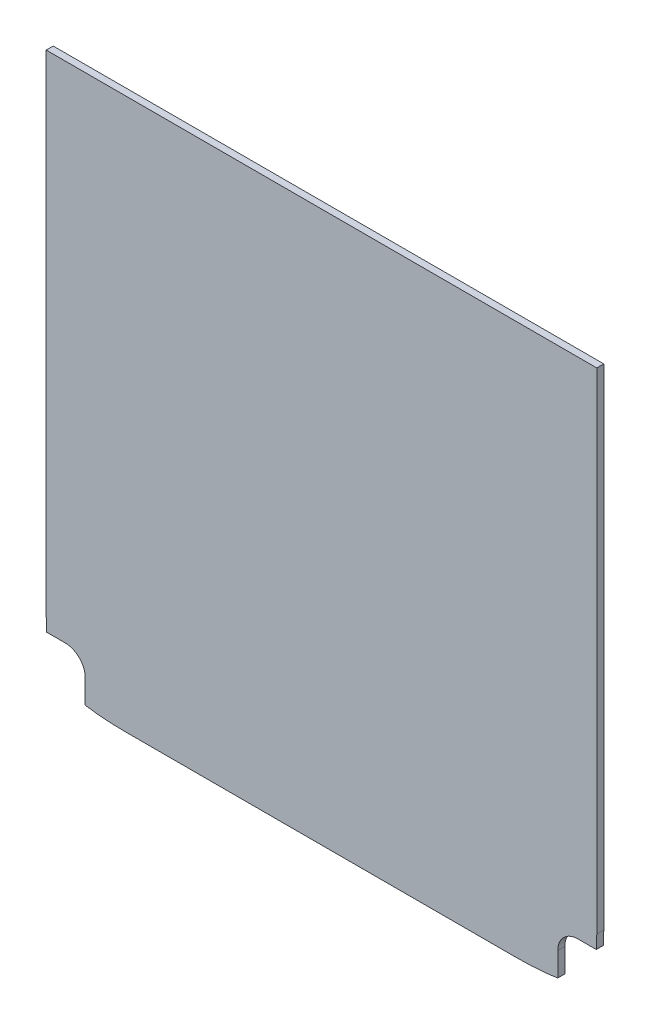
ISO-10303-21;
HEADER;
FILE_DESCRIPTION(('STEP AP214'),'2;1');
FILE_NAME('part.step','',(''),(''),'','','');
FILE_SCHEMA(('AUTOMOTIVE_DESIGN { 1 0 10303 214 1 1 1 1 }'));
ENDSEC;
DATA;
#1=APPLICATION_CONTEXT('core data for automotive mechanical design processes');
#2=APPLICATION_PROTOCOL_DEFINITION('international standard','automotive_design',2000,#1);
#3=PRODUCT_CONTEXT('',#1,'mechanical');
#4=PRODUCT('Part','Part','',(#3));
#5=PRODUCT_RELATED_PRODUCT_CATEGORY('part','',(#4));
#6=PRODUCT_DEFINITION_FORMATION('','',#4);
#7=PRODUCT_DEFINITION_CONTEXT('part definition',#1,'design');
#8=PRODUCT_DEFINITION('design','',#6,#7);
#9=PRODUCT_DEFINITION_SHAPE('','',#8);
#10=(LENGTH_UNIT() NAMED_UNIT(*) SI_UNIT(.MILLI.,.METRE.));
#11=(NAMED_UNIT(*) PLANE_ANGLE_UNIT() SI_UNIT($,.RADIAN.));
#12=(NAMED_UNIT(*) SI_UNIT($,.STERADIAN.) SOLID_ANGLE_UNIT());
#13=UNCERTAINTY_MEASURE_WITH_UNIT(LENGTH_MEASURE(1.E-05),#10,'distance_accuracy_value','');
#14=(GEOMETRIC_REPRESENTATION_CONTEXT(3) GLOBAL_UNCERTAINTY_ASSIGNED_CONTEXT((#13)) GLOBAL_UNIT_ASSIGNED_CONTEXT((#10,
#11,#12)) REPRESENTATION_CONTEXT('',''));
#15=CARTESIAN_POINT('',(0.,0.,0.));
#16=DIRECTION('',(0.,0.,1.));
#17=DIRECTION('',(1.,0.,0.));
#18=AXIS2_PLACEMENT_3D('',#15,#16,#17);
#19=CARTESIAN_POINT('',(-31.4,-3.06999999999998,-1.8));
#20=DIRECTION('',(0.,-1.,0.));
#21=DIRECTION('',(0.,0.,-1.));
#22=AXIS2_PLACEMENT_3D('',#19,#20,#21);
#23=PLANE('',#22);
#24=DIRECTION('',(-1.,0.,0.));
#25=VECTOR('',#24,1.);
#26=CARTESIAN_POINT('',(-31.4,-3.06999999999998,-2.6));
#27=LINE('',#26,#25);
#28=CARTESIAN_POINT('',(31.4,-3.06999999999998,-2.6));
#29=VERTEX_POINT('',#28);
#30=CARTESIAN_POINT('',(-31.4,-3.06999999999998,-2.6));
#31=VERTEX_POINT('',#30);
#32=EDGE_CURVE('E194',#29,#31,#27,.T.);
#33=ORIENTED_EDGE('',*,*,#32,.T.);
#34=DIRECTION('',(0.,0.,-1.));
#35=VECTOR('',#34,1.);
#36=CARTESIAN_POINT('',(-31.4,-3.06999999999998,-1.8));
#37=LINE('',#36,#35);
#38=CARTESIAN_POINT('',(-31.4,-3.06999999999998,-1.8));
#39=VERTEX_POINT('',#38);
#40=EDGE_CURVE('E11',#39,#31,#37,.T.);
#41=ORIENTED_EDGE('',*,*,#40,.F.);
#42=DIRECTION('',(-1.,0.,0.));
#43=VECTOR('',#42,1.);
#44=CARTESIAN_POINT('',(-31.4,-3.06999999999998,-1.8));
#45=LINE('',#44,#43);
#46=CARTESIAN_POINT('',(31.4,-3.06999999999998,-1.8));
#47=VERTEX_POINT('',#46);
#48=EDGE_CURVE('E274',#47,#39,#45,.T.);
#49=ORIENTED_EDGE('',*,*,#48,.F.);
#50=DIRECTION('',(0.,0.,-1.));
#51=VECTOR('',#50,1.);
#52=CARTESIAN_POINT('',(31.4,-3.06999999999998,-1.8));
#53=LINE('',#52,#51);
#54=EDGE_CURVE('E208',#47,#29,#53,.T.);
#55=ORIENTED_EDGE('',*,*,#54,.T.);
#56=EDGE_LOOP('',(#33,#41,#49,#55));
#57=FACE_BOUND('',#56,.T.);
#58=ADVANCED_FACE('F33',(#57),#23,.F.);
#59=CARTESIAN_POINT('',(-31.4,-59.,-1.8));
#60=DIRECTION('',(1.,0.,0.));
#61=DIRECTION('',(0.,1.,0.));
#62=AXIS2_PLACEMENT_3D('',#59,#60,#61);
#63=PLANE('',#62);
#64=DIRECTION('',(0.,-1.,0.));
#65=VECTOR('',#64,1.);
#66=CARTESIAN_POINT('',(-31.4,-59.,-2.6));
#67=LINE('',#66,#65);
#68=CARTESIAN_POINT('',(-31.4,-59.,-2.6));
#69=VERTEX_POINT('',#68);
#70=EDGE_CURVE('E200',#31,#69,#67,.T.);
#71=ORIENTED_EDGE('',*,*,#70,.T.);
#72=DIRECTION('',(0.,0.,-1.));
#73=VECTOR('',#72,1.);
#74=CARTESIAN_POINT('',(-31.4,-59.,-1.8));
#75=LINE('',#74,#73);
#76=CARTESIAN_POINT('',(-31.4,-59.,-1.8));
#77=VERTEX_POINT('',#76);
#78=EDGE_CURVE('E42',#77,#69,#75,.T.);
#79=ORIENTED_EDGE('',*,*,#78,.F.);
#80=DIRECTION('',(0.,-1.,0.));
#81=VECTOR('',#80,1.);
#82=CARTESIAN_POINT('',(-31.4,-59.,-1.8));
#83=LINE('',#82,#81);
#84=EDGE_CURVE('E113',#39,#77,#83,.T.);
#85=ORIENTED_EDGE('',*,*,#84,.F.);
#86=ORIENTED_EDGE('',*,*,#40,.T.);
#87=EDGE_LOOP('',(#71,#79,#85,#86));
#88=FACE_BOUND('',#87,.T.);
#89=ADVANCED_FACE('F265',(#88),#63,.F.);
#90=CARTESIAN_POINT('',(-31.4,-59.,-1.8));
#91=CARTESIAN_POINT('',(-31.4,-59.5647726423221,-1.8));
#92=CARTESIAN_POINT('',(-31.3799273594437,-60.0817827199579,-1.8));
#93=CARTESIAN_POINT('',(-31.3422494533232,-60.5499999999461,-1.8));
#94=B_SPLINE_CURVE_WITH_KNOTS('',3,(#90,#91,#92,#93),.UNSPECIFIED.,.F.,.F.,(4,4),(0.,
0.0796346763149644),.UNSPECIFIED.);
#95=DIRECTION('',(0.,0.,-1.));
#96=VECTOR('',#95,1.);
#97=SURFACE_OF_LINEAR_EXTRUSION('',#94,#96);
#98=CARTESIAN_POINT('',(-31.4,-59.,-2.6));
#99=CARTESIAN_POINT('',(-31.4,-59.5647726423221,-2.6));
#100=CARTESIAN_POINT('',(-31.3799273594437,-60.0817827199579,-2.6));
#101=CARTESIAN_POINT('',(-31.3422494533232,-60.5499999999461,-2.6));
#102=B_SPLINE_CURVE_WITH_KNOTS('',3,(#98,#99,#100,#101),.UNSPECIFIED.,.F.,.F.,(4,4),(0.,
0.0796346763149644),.UNSPECIFIED.);
#103=CARTESIAN_POINT('',(-31.3422494533232,-60.5499999999461,-2.6));
#104=VERTEX_POINT('',#103);
#105=EDGE_CURVE('E248',#69,#104,#102,.T.);
#106=ORIENTED_EDGE('',*,*,#105,.T.);
#107=DIRECTION('',(0.,0.,-1.));
#108=VECTOR('',#107,1.);
#109=CARTESIAN_POINT('',(-31.3422494533232,-60.5499999999461,-1.8));
#110=LINE('',#109,#108);
#111=CARTESIAN_POINT('',(-31.3422494533232,-60.5499999999461,-1.8));
#112=VERTEX_POINT('',#111);
#113=EDGE_CURVE('E221',#112,#104,#110,.T.);
#114=ORIENTED_EDGE('',*,*,#113,.F.);
#115=CARTESIAN_POINT('',(-31.3422494533232,-60.5499999999461,-1.8));
#116=CARTESIAN_POINT('',(-31.3799273594437,-60.0817827199579,-1.8));
#117=CARTESIAN_POINT('',(-31.4,-59.5647726423221,-1.8));
#118=CARTESIAN_POINT('',(-31.4,-59.,-1.8));
#119=B_SPLINE_CURVE_WITH_KNOTS('',3,(#115,#116,#117,#118),.UNSPECIFIED.,.F.,.F.,(4,4),(0.,
0.0796346763149644),.UNSPECIFIED.);
#120=EDGE_CURVE('E242',#77,#112,#119,.F.);
#121=ORIENTED_EDGE('',*,*,#120,.F.);
#122=ORIENTED_EDGE('',*,*,#78,.T.);
#123=EDGE_LOOP('',(#106,#114,#121,#122));
#124=FACE_BOUND('',#123,.T.);
#125=ADVANCED_FACE('F254',(#124),#97,.F.);
#126=CARTESIAN_POINT('',(-29.2500000000046,-60.5499999999461,-1.8));
#127=DIRECTION('',(0.,1.,0.));
#128=DIRECTION('',(0.,0.,1.));
#129=AXIS2_PLACEMENT_3D('',#126,#127,#128);
#130=PLANE('',#129);
#131=DIRECTION('',(1.,0.,0.));
#132=VECTOR('',#131,1.);
#133=CARTESIAN_POINT('',(-29.2500000000046,-60.5499999999461,-2.6));
#134=LINE('',#133,#132);
#135=CARTESIAN_POINT('',(-29.2500000000046,-60.5499999999461,-2.6));
#136=VERTEX_POINT('',#135);
#137=EDGE_CURVE('E204',#104,#136,#134,.T.);
#138=ORIENTED_EDGE('',*,*,#137,.T.);
#139=DIRECTION('',(0.,0.,-1.));
#140=VECTOR('',#139,1.);
#141=CARTESIAN_POINT('',(-29.2500000000046,-60.5499999999461,-1.8));
#142=LINE('',#141,#140);
#143=CARTESIAN_POINT('',(-29.2500000000046,-60.5499999999461,-1.8));
#144=VERTEX_POINT('',#143);
#145=EDGE_CURVE('E218',#144,#136,#142,.T.);
#146=ORIENTED_EDGE('',*,*,#145,.F.);
#147=DIRECTION('',(1.,0.,0.));
#148=VECTOR('',#147,1.);
#149=CARTESIAN_POINT('',(-29.2500000000046,-60.5499999999461,-1.8));
#150=LINE('',#149,#148);
#151=EDGE_CURVE('E239',#112,#144,#150,.T.);
#152=ORIENTED_EDGE('',*,*,#151,.F.);
#153=ORIENTED_EDGE('',*,*,#113,.T.);
#154=EDGE_LOOP('',(#138,#146,#152,#153));
#155=FACE_BOUND('',#154,.T.);
#156=ADVANCED_FACE('F264',(#155),#130,.F.);
#157=CARTESIAN_POINT('',(-29.2499999999962,-62.8499999999461,-1.8));
#158=DIRECTION('',(0.,0.,-1.));
#159=DIRECTION('',(-1.,0.,0.));
#160=AXIS2_PLACEMENT_3D('',#157,#158,#159);
#161=CYLINDRICAL_SURFACE('',#160,2.30000000000001);
#162=CARTESIAN_POINT('',(-29.2499999999962,-62.8499999999461,-2.6));
#163=DIRECTION('',(0.,0.,-1.));
#164=DIRECTION('',(1.,0.,0.));
#165=AXIS2_PLACEMENT_3D('',#162,#163,#164);
#166=CIRCLE('',#165,2.30000000000001);
#167=CARTESIAN_POINT('',(-26.9499999999962,-62.8500000000007,-2.6));
#168=VERTEX_POINT('',#167);
#169=EDGE_CURVE('E201',#136,#168,#166,.T.);
#170=ORIENTED_EDGE('',*,*,#169,.T.);
#171=DIRECTION('',(0.,0.,-1.));
#172=VECTOR('',#171,1.);
#173=CARTESIAN_POINT('',(-26.9499999999962,-62.8500000000007,-1.8));
#174=LINE('',#173,#172);
#175=CARTESIAN_POINT('',(-26.9499999999962,-62.8500000000007,-1.8));
#176=VERTEX_POINT('',#175);
#177=EDGE_CURVE('E215',#176,#168,#174,.T.);
#178=ORIENTED_EDGE('',*,*,#177,.F.);
#179=CARTESIAN_POINT('',(-29.2499999999962,-62.8499999999461,-1.8));
#180=DIRECTION('',(0.,0.,-1.));
#181=DIRECTION('',(1.,0.,0.));
#182=AXIS2_PLACEMENT_3D('',#179,#180,#181);
#183=CIRCLE('',#182,2.30000000000001);
#184=EDGE_CURVE('E241',#144,#176,#183,.T.);
#185=ORIENTED_EDGE('',*,*,#184,.F.);
#186=ORIENTED_EDGE('',*,*,#145,.T.);
#187=EDGE_LOOP('',(#170,#178,#185,#186));
#188=FACE_BOUND('',#187,.T.);
#189=ADVANCED_FACE('F472',(#188),#161,.F.);
#190=CARTESIAN_POINT('',(-26.9499999999962,-65.5586526538853,-1.8));
#191=DIRECTION('',(1.,0.,0.));
#192=DIRECTION('',(0.,0.,-1.));
#193=AXIS2_PLACEMENT_3D('',#190,#191,#192);
#194=PLANE('',#193);
#195=DIRECTION('',(0.,-1.,0.));
#196=VECTOR('',#195,1.);
#197=CARTESIAN_POINT('',(-26.9499999999962,-65.5586526538853,-2.6));
#198=LINE('',#197,#196);
#199=CARTESIAN_POINT('',(-26.9499999999962,-65.5586526538853,-2.6));
#200=VERTEX_POINT('',#199);
#201=EDGE_CURVE('E203',#168,#200,#198,.T.);
#202=ORIENTED_EDGE('',*,*,#201,.T.);
#203=DIRECTION('',(0.,0.,-1.));
#204=VECTOR('',#203,1.);
#205=CARTESIAN_POINT('',(-26.9499999999962,-65.5586526538853,-1.8));
#206=LINE('',#205,#204);
#207=CARTESIAN_POINT('',(-26.9499999999962,-65.5586526538853,-1.8));
#208=VERTEX_POINT('',#207);
#209=EDGE_CURVE('E219',#208,#200,#206,.T.);
#210=ORIENTED_EDGE('',*,*,#209,.F.);
#211=DIRECTION('',(0.,-1.,0.));
#212=VECTOR('',#211,1.);
#213=CARTESIAN_POINT('',(-26.9499999999962,-65.5586526538853,-1.8));
#214=LINE('',#213,#212);
#215=EDGE_CURVE('E279',#176,#208,#214,.T.);
#216=ORIENTED_EDGE('',*,*,#215,.F.);
#217=ORIENTED_EDGE('',*,*,#177,.T.);
#218=EDGE_LOOP('',(#202,#210,#216,#217));
#219=FACE_BOUND('',#218,.T.);
#220=ADVANCED_FACE('F296',(#219),#194,.F.);
#221=CARTESIAN_POINT('',(-26.9499999999962,-65.5586526538853,-1.8));
#222=CARTESIAN_POINT('',(-26.3530525880404,-65.6660159480834,-1.8));
#223=CARTESIAN_POINT('',(-25.665739747565,-65.7491722547393,-1.8));
#224=CARTESIAN_POINT('',(-24.0328892150861,-65.8692163600802,-1.8));
#225=CARTESIAN_POINT('',(-23.0666253583551,-65.9,-1.8));
#226=CARTESIAN_POINT('',(-22.,-65.9,-1.8));
#227=B_SPLINE_CURVE_WITH_KNOTS('',3,(#221,#222,#223,#224,#225,#226),.UNSPECIFIED.,.F.,.F.,(4,2,
4),(0.762959975228664,0.875000000000001,1.),.UNSPECIFIED.);
#228=DIRECTION('',(0.,0.,-1.));
#229=VECTOR('',#228,1.);
#230=SURFACE_OF_LINEAR_EXTRUSION('',#227,#229);
#231=CARTESIAN_POINT('',(-26.9499999999962,-65.5586526538853,-2.6));
#232=CARTESIAN_POINT('',(-26.3530525880404,-65.6660159480834,-2.6));
#233=CARTESIAN_POINT('',(-25.665739747565,-65.7491722547393,-2.6));
#234=CARTESIAN_POINT('',(-24.0328892150861,-65.8692163600802,-2.6));
#235=CARTESIAN_POINT('',(-23.0666253583551,-65.9,-2.6));
#236=CARTESIAN_POINT('',(-22.,-65.9,-2.6));
#237=B_SPLINE_CURVE_WITH_KNOTS('',3,(#231,#232,#233,#234,#235,#236),.UNSPECIFIED.,.F.,.F.,(4,2,
4),(0.762959975228664,0.875000000000001,1.),.UNSPECIFIED.);
#238=CARTESIAN_POINT('',(-22.,-65.9,-2.6));
#239=VERTEX_POINT('',#238);
#240=EDGE_CURVE('E321',#200,#239,#237,.T.);
#241=ORIENTED_EDGE('',*,*,#240,.T.);
#242=DIRECTION('',(0.,0.,-1.));
#243=VECTOR('',#242,1.);
#244=CARTESIAN_POINT('',(-22.,-65.9,-1.8));
#245=LINE('',#244,#243);
#246=CARTESIAN_POINT('',(-22.,-65.9,-1.8));
#247=VERTEX_POINT('',#246);
#248=EDGE_CURVE('E377',#247,#239,#245,.T.);
#249=ORIENTED_EDGE('',*,*,#248,.F.);
#250=CARTESIAN_POINT('',(-22.,-65.9,-1.8));
#251=CARTESIAN_POINT('',(-23.0666253583551,-65.9,-1.8));
#252=CARTESIAN_POINT('',(-24.0328892150861,-65.8692163600802,-1.8));
#253=CARTESIAN_POINT('',(-25.665739747565,-65.7491722547393,-1.8));
#254=CARTESIAN_POINT('',(-26.3530525880404,-65.6660159480834,-1.8));
#255=CARTESIAN_POINT('',(-26.9499999999962,-65.5586526538853,-1.8));
#256=B_SPLINE_CURVE_WITH_KNOTS('',3,(#250,#251,#252,#253,#254,#255),.UNSPECIFIED.,.F.,.F.,(4,2,
4),(0.762959975228664,0.887959975228663,1.),.UNSPECIFIED.);
#257=EDGE_CURVE('E365',#208,#247,#256,.F.);
#258=ORIENTED_EDGE('',*,*,#257,.F.);
#259=ORIENTED_EDGE('',*,*,#209,.T.);
#260=EDGE_LOOP('',(#241,#249,#258,#259));
#261=FACE_BOUND('',#260,.T.);
#262=ADVANCED_FACE('F290',(#261),#230,.F.);
#263=CARTESIAN_POINT('',(-22.,-65.9,-1.8));
#264=DIRECTION('',(0.,1.,0.));
#265=DIRECTION('',(0.,0.,1.));
#266=AXIS2_PLACEMENT_3D('',#263,#264,#265);
#267=PLANE('',#266);
#268=DIRECTION('',(1.,0.,0.));
#269=VECTOR('',#268,1.);
#270=CARTESIAN_POINT('',(-22.,-65.9,-2.6));
#271=LINE('',#270,#269);
#272=CARTESIAN_POINT('',(22.,-65.9,-2.6));
#273=VERTEX_POINT('',#272);
#274=EDGE_CURVE('E350',#239,#273,#271,.T.);
#275=ORIENTED_EDGE('',*,*,#274,.T.);
#276=DIRECTION('',(0.,0.,-1.));
#277=VECTOR('',#276,1.);
#278=CARTESIAN_POINT('',(22.,-65.9,-1.8));
#279=LINE('',#278,#277);
#280=CARTESIAN_POINT('',(22.,-65.9,-1.8));
#281=VERTEX_POINT('',#280);
#282=EDGE_CURVE('E389',#281,#273,#279,.T.);
#283=ORIENTED_EDGE('',*,*,#282,.F.);
#284=DIRECTION('',(1.,0.,0.));
#285=VECTOR('',#284,1.);
#286=CARTESIAN_POINT('',(-22.,-65.9,-1.8));
#287=LINE('',#286,#285);
#288=EDGE_CURVE('E379',#247,#281,#287,.T.);
#289=ORIENTED_EDGE('',*,*,#288,.F.);
#290=ORIENTED_EDGE('',*,*,#248,.T.);
#291=EDGE_LOOP('',(#275,#283,#289,#290));
#292=FACE_BOUND('',#291,.T.);
#293=ADVANCED_FACE('F295',(#292),#267,.F.);
#294=CARTESIAN_POINT('',(22.,-65.9,-1.8));
#295=CARTESIAN_POINT('',(23.0666253583551,-65.9,-1.8));
#296=CARTESIAN_POINT('',(24.0328892150861,-65.8692163600802,-1.8));
#297=CARTESIAN_POINT('',(25.665739747565,-65.7491722547393,-1.8));
#298=CARTESIAN_POINT('',(26.3530525880404,-65.6660159480834,-1.8));
#299=CARTESIAN_POINT('',(26.9499999999962,-65.5586526538853,-1.8));
#300=B_SPLINE_CURVE_WITH_KNOTS('',3,(#294,#295,#296,#297,#298,#299),.UNSPECIFIED.,.F.,.F.,(4,2,
4),(0.762959975228664,0.887959975228663,1.),.UNSPECIFIED.);
#301=DIRECTION('',(0.,0.,-1.));
#302=VECTOR('',#301,1.);
#303=SURFACE_OF_LINEAR_EXTRUSION('',#300,#302);
#304=CARTESIAN_POINT('',(22.,-65.9,-2.6));
#305=CARTESIAN_POINT('',(23.0666253583551,-65.9,-2.6));
#306=CARTESIAN_POINT('',(24.0328892150861,-65.8692163600802,-2.6));
#307=CARTESIAN_POINT('',(25.665739747565,-65.7491722547393,-2.6));
#308=CARTESIAN_POINT('',(26.3530525880404,-65.6660159480834,-2.6));
#309=CARTESIAN_POINT('',(26.9499999999962,-65.5586526538853,-2.6));
#310=B_SPLINE_CURVE_WITH_KNOTS('',3,(#304,#305,#306,#307,#308,#309),.UNSPECIFIED.,.F.,.F.,(4,2,
4),(0.762959975228664,0.887959975228663,1.),.UNSPECIFIED.);
#311=CARTESIAN_POINT('',(26.9499999999962,-65.5586526538853,-2.6));
#312=VERTEX_POINT('',#311);
#313=EDGE_CURVE('E357',#273,#312,#310,.T.);
#314=ORIENTED_EDGE('',*,*,#313,.T.);
#315=DIRECTION('',(0.,0.,-1.));
#316=VECTOR('',#315,1.);
#317=CARTESIAN_POINT('',(26.9499999999962,-65.5586526538853,-1.8));
#318=LINE('',#317,#316);
#319=CARTESIAN_POINT('',(26.9499999999962,-65.5586526538853,-1.8));
#320=VERTEX_POINT('',#319);
#321=EDGE_CURVE('E214',#320,#312,#318,.T.);
#322=ORIENTED_EDGE('',*,*,#321,.F.);
#323=CARTESIAN_POINT('',(26.9499999999962,-65.5586526538853,-1.8));
#324=CARTESIAN_POINT('',(26.3530525880404,-65.6660159480834,-1.8));
#325=CARTESIAN_POINT('',(25.665739747565,-65.7491722547393,-1.8));
#326=CARTESIAN_POINT('',(24.0328892150861,-65.8692163600802,-1.8));
#327=CARTESIAN_POINT('',(23.0666253583551,-65.9,-1.8));
#328=CARTESIAN_POINT('',(22.,-65.9,-1.8));
#329=B_SPLINE_CURVE_WITH_KNOTS('',3,(#323,#324,#325,#326,#327,#328),.UNSPECIFIED.,.F.,.F.,(4,2,
4),(0.762959975228664,0.875000000000001,1.),.UNSPECIFIED.);
#330=EDGE_CURVE('E380',#281,#320,#329,.F.);
#331=ORIENTED_EDGE('',*,*,#330,.F.);
#332=ORIENTED_EDGE('',*,*,#282,.T.);
#333=EDGE_LOOP('',(#314,#322,#331,#332));
#334=FACE_BOUND('',#333,.T.);
#335=ADVANCED_FACE('F413',(#334),#303,.F.);
#336=CARTESIAN_POINT('',(26.9499999999962,-65.5586526538853,-1.8));
#337=DIRECTION('',(-1.,0.,0.));
#338=DIRECTION('',(0.,0.,1.));
#339=AXIS2_PLACEMENT_3D('',#336,#337,#338);
#340=PLANE('',#339);
#341=DIRECTION('',(0.,1.,0.));
#342=VECTOR('',#341,1.);
#343=CARTESIAN_POINT('',(26.9499999999962,-65.5586526538853,-2.6));
#344=LINE('',#343,#342);
#345=CARTESIAN_POINT('',(26.9499999999962,-62.8500000000007,-2.6));
#346=VERTEX_POINT('',#345);
#347=EDGE_CURVE('E207',#312,#346,#344,.T.);
#348=ORIENTED_EDGE('',*,*,#347,.T.);
#349=DIRECTION('',(0.,0.,-1.));
#350=VECTOR('',#349,1.);
#351=CARTESIAN_POINT('',(26.9499999999962,-62.8500000000007,-1.8));
#352=LINE('',#351,#350);
#353=CARTESIAN_POINT('',(26.9499999999962,-62.8500000000007,-1.8));
#354=VERTEX_POINT('',#353);
#355=EDGE_CURVE('E211',#354,#346,#352,.T.);
#356=ORIENTED_EDGE('',*,*,#355,.F.);
#357=DIRECTION('',(0.,1.,0.));
#358=VECTOR('',#357,1.);
#359=CARTESIAN_POINT('',(26.9499999999962,-65.5586526538853,-1.8));
#360=LINE('',#359,#358);
#361=EDGE_CURVE('E406',#320,#354,#360,.T.);
#362=ORIENTED_EDGE('',*,*,#361,.F.);
#363=ORIENTED_EDGE('',*,*,#321,.T.);
#364=EDGE_LOOP('',(#348,#356,#362,#363));
#365=FACE_BOUND('',#364,.T.);
#366=ADVANCED_FACE('F422',(#365),#340,.F.);
#367=CARTESIAN_POINT('',(29.2499999999962,-62.8499999999461,-1.8));
#368=DIRECTION('',(0.,0.,-1.));
#369=DIRECTION('',(-1.,0.,0.));
#370=AXIS2_PLACEMENT_3D('',#367,#368,#369);
#371=CYLINDRICAL_SURFACE('',#370,2.30000000000001);
#372=CARTESIAN_POINT('',(29.2499999999962,-62.8499999999461,-2.6));
#373=DIRECTION('',(0.,0.,-1.));
#374=DIRECTION('',(-1.,0.,0.));
#375=AXIS2_PLACEMENT_3D('',#372,#373,#374);
#376=CIRCLE('',#375,2.30000000000001);
#377=CARTESIAN_POINT('',(29.2500000000046,-60.5499999999461,-2.6));
#378=VERTEX_POINT('',#377);
#379=EDGE_CURVE('E205',#346,#378,#376,.T.);
#380=ORIENTED_EDGE('',*,*,#379,.T.);
#381=DIRECTION('',(0.,0.,-1.));
#382=VECTOR('',#381,1.);
#383=CARTESIAN_POINT('',(29.2500000000046,-60.5499999999461,-1.8));
#384=LINE('',#383,#382);
#385=CARTESIAN_POINT('',(29.2500000000046,-60.5499999999461,-1.8));
#386=VERTEX_POINT('',#385);
#387=EDGE_CURVE('E160',#386,#378,#384,.T.);
#388=ORIENTED_EDGE('',*,*,#387,.F.);
#389=CARTESIAN_POINT('',(29.2499999999962,-62.8499999999461,-1.8));
#390=DIRECTION('',(0.,0.,-1.));
#391=DIRECTION('',(-1.,0.,0.));
#392=AXIS2_PLACEMENT_3D('',#389,#390,#391);
#393=CIRCLE('',#392,2.30000000000001);
#394=EDGE_CURVE('E151',#354,#386,#393,.T.);
#395=ORIENTED_EDGE('',*,*,#394,.F.);
#396=ORIENTED_EDGE('',*,*,#355,.T.);
#397=EDGE_LOOP('',(#380,#388,#395,#396));
#398=FACE_BOUND('',#397,.T.);
#399=ADVANCED_FACE('F503',(#398),#371,.F.);
#400=CARTESIAN_POINT('',(29.2500000000046,-60.5499999999461,-1.8));
#401=DIRECTION('',(0.,1.,0.));
#402=DIRECTION('',(0.,0.,1.));
#403=AXIS2_PLACEMENT_3D('',#400,#401,#402);
#404=PLANE('',#403);
#405=DIRECTION('',(1.,0.,0.));
#406=VECTOR('',#405,1.);
#407=CARTESIAN_POINT('',(29.2500000000046,-60.5499999999461,-2.6));
#408=LINE('',#407,#406);
#409=CARTESIAN_POINT('',(31.3422494533232,-60.5499999999461,-2.6));
#410=VERTEX_POINT('',#409);
#411=EDGE_CURVE('E159',#378,#410,#408,.T.);
#412=ORIENTED_EDGE('',*,*,#411,.T.);
#413=DIRECTION('',(0.,0.,-1.));
#414=VECTOR('',#413,1.);
#415=CARTESIAN_POINT('',(31.3422494533232,-60.5499999999461,-1.8));
#416=LINE('',#415,#414);
#417=CARTESIAN_POINT('',(31.3422494533232,-60.5499999999461,-1.8));
#418=VERTEX_POINT('',#417);
#419=EDGE_CURVE('E156',#418,#410,#416,.T.);
#420=ORIENTED_EDGE('',*,*,#419,.F.);
#421=DIRECTION('',(1.,0.,0.));
#422=VECTOR('',#421,1.);
#423=CARTESIAN_POINT('',(29.2500000000046,-60.5499999999461,-1.8));
#424=LINE('',#423,#422);
#425=EDGE_CURVE('E144',#386,#418,#424,.T.);
#426=ORIENTED_EDGE('',*,*,#425,.F.);
#427=ORIENTED_EDGE('',*,*,#387,.T.);
#428=EDGE_LOOP('',(#412,#420,#426,#427));
#429=FACE_BOUND('',#428,.T.);
#430=ADVANCED_FACE('F157',(#429),#404,.F.);
#431=CARTESIAN_POINT('',(31.3422494533232,-60.5499999999461,-1.8));
#432=CARTESIAN_POINT('',(31.3799273594437,-60.0817827199579,-1.8));
#433=CARTESIAN_POINT('',(31.4,-59.5647726423221,-1.8));
#434=CARTESIAN_POINT('',(31.4,-59.,-1.8));
#435=B_SPLINE_CURVE_WITH_KNOTS('',3,(#431,#432,#433,#434),.UNSPECIFIED.,.F.,.F.,(4,4),(0.,
0.0796346763149644),.UNSPECIFIED.);
#436=DIRECTION('',(0.,0.,-1.));
#437=VECTOR('',#436,1.);
#438=SURFACE_OF_LINEAR_EXTRUSION('',#435,#437);
#439=CARTESIAN_POINT('',(31.3422494533232,-60.5499999999461,-2.6));
#440=CARTESIAN_POINT('',(31.3799273594437,-60.0817827199579,-2.6));
#441=CARTESIAN_POINT('',(31.4,-59.5647726423221,-2.6));
#442=CARTESIAN_POINT('',(31.4,-59.,-2.6));
#443=B_SPLINE_CURVE_WITH_KNOTS('',3,(#439,#440,#441,#442),.UNSPECIFIED.,.F.,.F.,(4,4),(0.,
0.0796346763149644),.UNSPECIFIED.);
#444=CARTESIAN_POINT('',(31.4,-59.,-2.6));
#445=VERTEX_POINT('',#444);
#446=EDGE_CURVE('E98',#410,#445,#443,.T.);
#447=ORIENTED_EDGE('',*,*,#446,.T.);
#448=DIRECTION('',(0.,0.,-1.));
#449=VECTOR('',#448,1.);
#450=CARTESIAN_POINT('',(31.4,-59.,-1.8));
#451=LINE('',#450,#449);
#452=CARTESIAN_POINT('',(31.4,-59.,-1.8));
#453=VERTEX_POINT('',#452);
#454=EDGE_CURVE('E161',#453,#445,#451,.T.);
#455=ORIENTED_EDGE('',*,*,#454,.F.);
#456=CARTESIAN_POINT('',(31.4,-59.,-1.8));
#457=CARTESIAN_POINT('',(31.4,-59.5647726423221,-1.8));
#458=CARTESIAN_POINT('',(31.3799273594437,-60.0817827199579,-1.8));
#459=CARTESIAN_POINT('',(31.3422494533232,-60.5499999999461,-1.8));
#460=B_SPLINE_CURVE_WITH_KNOTS('',3,(#456,#457,#458,#459),.UNSPECIFIED.,.F.,.F.,(4,4),(0.,
0.0796346763149644),.UNSPECIFIED.);
#461=EDGE_CURVE('E148',#418,#453,#460,.F.);
#462=ORIENTED_EDGE('',*,*,#461,.F.);
#463=ORIENTED_EDGE('',*,*,#419,.T.);
#464=EDGE_LOOP('',(#447,#455,#462,#463));
#465=FACE_BOUND('',#464,.T.);
#466=ADVANCED_FACE('F164',(#465),#438,.F.);
#467=CARTESIAN_POINT('',(31.4,-59.,-1.8));
#468=DIRECTION('',(-1.,0.,0.));
#469=DIRECTION('',(0.,0.,1.));
#470=AXIS2_PLACEMENT_3D('',#467,#468,#469);
#471=PLANE('',#470);
#472=DIRECTION('',(0.,1.,0.));
#473=VECTOR('',#472,1.);
#474=CARTESIAN_POINT('',(31.4,-59.,-2.6));
#475=LINE('',#474,#473);
#476=EDGE_CURVE('E105',#445,#29,#475,.T.);
#477=ORIENTED_EDGE('',*,*,#476,.T.);
#478=ORIENTED_EDGE('',*,*,#54,.F.);
#479=DIRECTION('',(0.,1.,0.));
#480=VECTOR('',#479,1.);
#481=CARTESIAN_POINT('',(31.4,-59.,-1.8));
#482=LINE('',#481,#480);
#483=EDGE_CURVE('E51',#453,#47,#482,.T.);
#484=ORIENTED_EDGE('',*,*,#483,.F.);
#485=ORIENTED_EDGE('',*,*,#454,.T.);
#486=EDGE_LOOP('',(#477,#478,#484,#485));
#487=FACE_BOUND('',#486,.T.);
#488=ADVANCED_FACE('F184',(#487),#471,.F.);
#489=CARTESIAN_POINT('',(31.3852539414568,-59.8112082608483,-1.8));
#490=DIRECTION('',(0.,0.,1.));
#491=DIRECTION('',(1.,0.,0.));
#492=AXIS2_PLACEMENT_3D('',#489,#490,#491);
#493=PLANE('',#492);
#494=ORIENTED_EDGE('',*,*,#48,.T.);
#495=ORIENTED_EDGE('',*,*,#84,.T.);
#496=ORIENTED_EDGE('',*,*,#120,.T.);
#497=ORIENTED_EDGE('',*,*,#151,.T.);
#498=ORIENTED_EDGE('',*,*,#184,.T.);
#499=ORIENTED_EDGE('',*,*,#215,.T.);
#500=ORIENTED_EDGE('',*,*,#257,.T.);
#501=ORIENTED_EDGE('',*,*,#288,.T.);
#502=ORIENTED_EDGE('',*,*,#330,.T.);
#503=ORIENTED_EDGE('',*,*,#361,.T.);
#504=ORIENTED_EDGE('',*,*,#394,.T.);
#505=ORIENTED_EDGE('',*,*,#425,.T.);
#506=ORIENTED_EDGE('',*,*,#461,.T.);
#507=ORIENTED_EDGE('',*,*,#483,.T.);
#508=EDGE_LOOP('',(#494,#495,#496,#497,#498,#499,#500,#501,#502,#503,#504,#505,#506,#507));
#509=FACE_BOUND('',#508,.T.);
#510=ADVANCED_FACE('F146',(#509),#493,.T.);
#511=CARTESIAN_POINT('',(31.3852539414568,-59.8112082608483,-2.6));
#512=DIRECTION('',(0.,0.,1.));
#513=DIRECTION('',(1.,0.,0.));
#514=AXIS2_PLACEMENT_3D('',#511,#512,#513);
#515=PLANE('',#514);
#516=ORIENTED_EDGE('',*,*,#32,.F.);
#517=ORIENTED_EDGE('',*,*,#476,.F.);
#518=ORIENTED_EDGE('',*,*,#446,.F.);
#519=ORIENTED_EDGE('',*,*,#411,.F.);
#520=ORIENTED_EDGE('',*,*,#379,.F.);
#521=ORIENTED_EDGE('',*,*,#347,.F.);
#522=ORIENTED_EDGE('',*,*,#313,.F.);
#523=ORIENTED_EDGE('',*,*,#274,.F.);
#524=ORIENTED_EDGE('',*,*,#240,.F.);
#525=ORIENTED_EDGE('',*,*,#201,.F.);
#526=ORIENTED_EDGE('',*,*,#169,.F.);
#527=ORIENTED_EDGE('',*,*,#137,.F.);
#528=ORIENTED_EDGE('',*,*,#105,.F.);
#529=ORIENTED_EDGE('',*,*,#70,.F.);
#530=EDGE_LOOP('',(#516,#517,#518,#519,#520,#521,#522,#523,#524,#525,#526,#527,#528,#529));
#531=FACE_BOUND('',#530,.T.);
#532=ADVANCED_FACE('F326',(#531),#515,.F.);
#533=CLOSED_SHELL('',(#58,#89,#125,#156,#189,#220,#262,#293,#335,#366,#399,#430,#466,#488,#510,#532));
#534=MANIFOLD_SOLID_BREP('B2',#533);
#535=ADVANCED_BREP_SHAPE_REPRESENTATION('',(#18,#534),#14);
#536=SHAPE_DEFINITION_REPRESENTATION(#9,#535);
ENDSEC;
END-ISO-10303-21;
